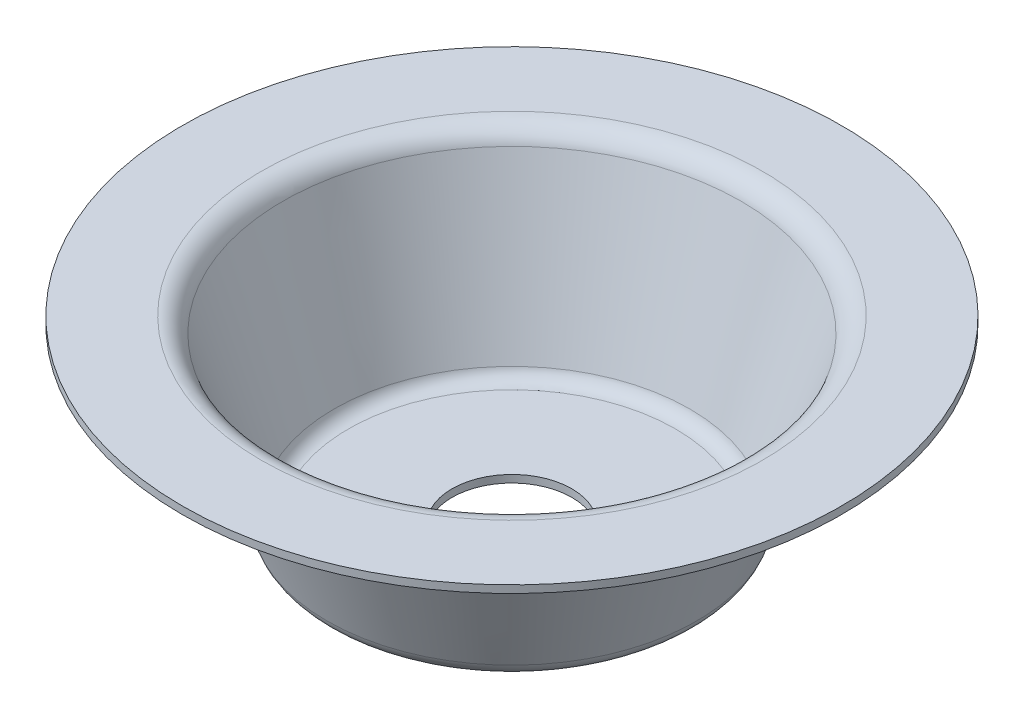
ISO-10303-21;
HEADER;
FILE_DESCRIPTION(('STEP AP214'),'2;1');
FILE_NAME('part.step','',(''),(''),'','','');
FILE_SCHEMA(('AUTOMOTIVE_DESIGN { 1 0 10303 214 1 1 1 1 }'));
ENDSEC;
DATA;
#1=APPLICATION_CONTEXT('core data for automotive mechanical design processes');
#2=APPLICATION_PROTOCOL_DEFINITION('international standard','automotive_design',2000,#1);
#3=PRODUCT_CONTEXT('',#1,'mechanical');
#4=PRODUCT('Part','Part','',(#3));
#5=PRODUCT_RELATED_PRODUCT_CATEGORY('part','',(#4));
#6=PRODUCT_DEFINITION_FORMATION('','',#4);
#7=PRODUCT_DEFINITION_CONTEXT('part definition',#1,'design');
#8=PRODUCT_DEFINITION('design','',#6,#7);
#9=PRODUCT_DEFINITION_SHAPE('','',#8);
#10=(LENGTH_UNIT() NAMED_UNIT(*) SI_UNIT(.MILLI.,.METRE.));
#11=(NAMED_UNIT(*) PLANE_ANGLE_UNIT() SI_UNIT($,.RADIAN.));
#12=(NAMED_UNIT(*) SI_UNIT($,.STERADIAN.) SOLID_ANGLE_UNIT());
#13=UNCERTAINTY_MEASURE_WITH_UNIT(LENGTH_MEASURE(1.E-05),#10,'distance_accuracy_value','');
#14=(GEOMETRIC_REPRESENTATION_CONTEXT(3) GLOBAL_UNCERTAINTY_ASSIGNED_CONTEXT((#13)) GLOBAL_UNIT_ASSIGNED_CONTEXT((#10,
#11,#12)) REPRESENTATION_CONTEXT('',''));
#15=CARTESIAN_POINT('',(0.,0.,0.));
#16=DIRECTION('',(0.,0.,1.));
#17=DIRECTION('',(1.,0.,0.));
#18=AXIS2_PLACEMENT_3D('',#15,#16,#17);
#19=CARTESIAN_POINT('',(-53.0884105236782,39.6875,0.));
#20=DIRECTION('',(0.,1.,0.));
#21=DIRECTION('',(0.,0.,1.));
#22=AXIS2_PLACEMENT_3D('',#19,#20,#21);
#23=PLANE('',#22);
#24=CARTESIAN_POINT('',(0.,39.6875,0.));
#25=DIRECTION('',(0.,1.,0.));
#26=DIRECTION('',(0.,0.,1.));
#27=AXIS2_PLACEMENT_3D('',#24,#25,#26);
#28=CIRCLE('',#27,69.85);
#29=CARTESIAN_POINT('',(0.,39.6875,69.85));
#30=VERTEX_POINT('',#29);
#31=EDGE_CURVE('E10',#30,#30,#28,.T.);
#32=ORIENTED_EDGE('',*,*,#31,.T.);
#33=EDGE_LOOP('',(#32));
#34=FACE_BOUND('',#33,.T.);
#35=CARTESIAN_POINT('',(0.,39.6875,0.));
#36=DIRECTION('',(0.,1.,0.));
#37=DIRECTION('',(0.,0.,1.));
#38=AXIS2_PLACEMENT_3D('',#35,#36,#37);
#39=CIRCLE('',#38,53.0884105236782);
#40=CARTESIAN_POINT('',(0.,39.6875,53.0884105236782));
#41=VERTEX_POINT('',#40);
#42=EDGE_CURVE('E71',#41,#41,#39,.T.);
#43=ORIENTED_EDGE('',*,*,#42,.F.);
#44=EDGE_LOOP('',(#43));
#45=FACE_BOUND('',#44,.T.);
#46=ADVANCED_FACE('F37',(#34,#45),#23,.T.);
#47=CARTESIAN_POINT('',(0.,40.5012674271229,0.));
#48=DIRECTION('',(0.,1.,0.));
#49=DIRECTION('',(0.,0.,1.));
#50=AXIS2_PLACEMENT_3D('',#47,#48,#49);
#51=CYLINDRICAL_SURFACE('',#50,69.85);
#52=ORIENTED_EDGE('',*,*,#31,.F.);
#53=EDGE_LOOP('',(#52));
#54=FACE_BOUND('',#53,.T.);
#55=CARTESIAN_POINT('',(0.,38.1,0.));
#56=DIRECTION('',(0.,1.,0.));
#57=DIRECTION('',(0.,0.,1.));
#58=AXIS2_PLACEMENT_3D('',#55,#56,#57);
#59=CIRCLE('',#58,69.85);
#60=CARTESIAN_POINT('',(0.,38.1,69.85));
#61=VERTEX_POINT('',#60);
#62=EDGE_CURVE('E44',#61,#61,#59,.T.);
#63=ORIENTED_EDGE('',*,*,#62,.T.);
#64=EDGE_LOOP('',(#63));
#65=FACE_BOUND('',#64,.T.);
#66=ADVANCED_FACE('F103',(#54,#65),#51,.T.);
#67=CARTESIAN_POINT('',(-53.0884105236782,38.1,0.));
#68=DIRECTION('',(0.,1.,0.));
#69=DIRECTION('',(0.,0.,1.));
#70=AXIS2_PLACEMENT_3D('',#67,#68,#69);
#71=PLANE('',#70);
#72=ORIENTED_EDGE('',*,*,#62,.F.);
#73=EDGE_LOOP('',(#72));
#74=FACE_BOUND('',#73,.T.);
#75=CARTESIAN_POINT('',(0.,38.1,0.));
#76=DIRECTION('',(0.,1.,0.));
#77=DIRECTION('',(0.,0.,1.));
#78=AXIS2_PLACEMENT_3D('',#75,#76,#77);
#79=CIRCLE('',#78,53.0884105236782);
#80=CARTESIAN_POINT('',(0.,38.1,53.0884105236782));
#81=VERTEX_POINT('',#80);
#82=EDGE_CURVE('E48',#81,#81,#79,.T.);
#83=ORIENTED_EDGE('',*,*,#82,.T.);
#84=EDGE_LOOP('',(#83));
#85=FACE_BOUND('',#84,.T.);
#86=ADVANCED_FACE('F107',(#74,#85),#71,.F.);
#87=CARTESIAN_POINT('',(0.,34.925,0.));
#88=DIRECTION('',(0.,1.,0.));
#89=DIRECTION('',(0.,0.,1.));
#90=AXIS2_PLACEMENT_3D('',#87,#88,#89);
#91=TOROIDAL_SURFACE('',#90,53.0884105236782,3.175);
#92=ORIENTED_EDGE('',*,*,#82,.F.);
#93=EDGE_LOOP('',(#92));
#94=FACE_BOUND('',#93,.T.);
#95=CARTESIAN_POINT('',(0.,35.9290231571034,0.));
#96=DIRECTION('',(0.,1.,0.));
#97=DIRECTION('',(0.,0.,1.));
#98=AXIS2_PLACEMENT_3D('',#95,#96,#97);
#99=CIRCLE('',#98,50.0763410523678);
#100=CARTESIAN_POINT('',(0.,35.9290231571034,50.0763410523678));
#101=VERTEX_POINT('',#100);
#102=EDGE_CURVE('E53',#101,#101,#99,.T.);
#103=ORIENTED_EDGE('',*,*,#102,.T.);
#104=EDGE_LOOP('',(#103));
#105=FACE_BOUND('',#104,.T.);
#106=ADVANCED_FACE('F150',(#94,#105),#91,.F.);
#107=CARTESIAN_POINT('',(0.,3.2564652643448,0.));
#108=DIRECTION('',(0.,1.,0.));
#109=DIRECTION('',(0.,0.,1.));
#110=AXIS2_PLACEMENT_3D('',#107,#108,#109);
#111=CONICAL_SURFACE('',#110,39.1854884214483,0.321750554396642);
#112=ORIENTED_EDGE('',*,*,#102,.F.);
#113=EDGE_LOOP('',(#112));
#114=FACE_BOUND('',#113,.T.);
#115=CARTESIAN_POINT('',(0.,3.2564652643448,0.));
#116=DIRECTION('',(0.,1.,0.));
#117=DIRECTION('',(0.,0.,1.));
#118=AXIS2_PLACEMENT_3D('',#115,#116,#117);
#119=CIRCLE('',#118,39.1854884214483);
#120=CARTESIAN_POINT('',(0.,3.2564652643448,39.1854884214483));
#121=VERTEX_POINT('',#120);
#122=EDGE_CURVE('E56',#121,#121,#119,.T.);
#123=ORIENTED_EDGE('',*,*,#122,.T.);
#124=EDGE_LOOP('',(#123));
#125=FACE_BOUND('',#124,.T.);
#126=ADVANCED_FACE('F142',(#114,#125),#111,.T.);
#127=CARTESIAN_POINT('',(0.,4.7625,0.));
#128=DIRECTION('',(0.,1.,0.));
#129=DIRECTION('',(0.,0.,1.));
#130=AXIS2_PLACEMENT_3D('',#127,#128,#129);
#131=TOROIDAL_SURFACE('',#130,34.6673842144827,4.7625);
#132=ORIENTED_EDGE('',*,*,#122,.F.);
#133=EDGE_LOOP('',(#132));
#134=FACE_BOUND('',#133,.T.);
#135=CARTESIAN_POINT('',(0.,0.,0.));
#136=DIRECTION('',(0.,1.,0.));
#137=DIRECTION('',(0.,0.,1.));
#138=AXIS2_PLACEMENT_3D('',#135,#136,#137);
#139=CIRCLE('',#138,34.6673842144827);
#140=CARTESIAN_POINT('',(0.,0.,34.6673842144827));
#141=VERTEX_POINT('',#140);
#142=EDGE_CURVE('E59',#141,#141,#139,.T.);
#143=ORIENTED_EDGE('',*,*,#142,.T.);
#144=EDGE_LOOP('',(#143));
#145=FACE_BOUND('',#144,.T.);
#146=ADVANCED_FACE('F133',(#134,#145),#131,.T.);
#147=CARTESIAN_POINT('',(0.,0.,0.));
#148=DIRECTION('',(0.,1.,0.));
#149=DIRECTION('',(0.,0.,1.));
#150=AXIS2_PLACEMENT_3D('',#147,#148,#149);
#151=PLANE('',#150);
#152=CARTESIAN_POINT('',(0.,0.,0.));
#153=DIRECTION('',(0.,-1.,0.));
#154=DIRECTION('',(0.,0.,-1.));
#155=AXIS2_PLACEMENT_3D('',#152,#153,#154);
#156=CIRCLE('',#155,12.7);
#157=CARTESIAN_POINT('',(0.,0.,-12.7));
#158=VERTEX_POINT('',#157);
#159=EDGE_CURVE('E74',#158,#158,#156,.T.);
#160=ORIENTED_EDGE('',*,*,#159,.F.);
#161=EDGE_LOOP('',(#160));
#162=FACE_BOUND('',#161,.T.);
#163=ORIENTED_EDGE('',*,*,#142,.F.);
#164=EDGE_LOOP('',(#163));
#165=FACE_BOUND('',#164,.T.);
#166=ADVANCED_FACE('F87',(#162,#165),#151,.F.);
#167=CARTESIAN_POINT('',(0.,1.5875,0.));
#168=DIRECTION('',(0.,1.,0.));
#169=DIRECTION('',(0.,0.,1.));
#170=AXIS2_PLACEMENT_3D('',#167,#168,#169);
#171=PLANE('',#170);
#172=CARTESIAN_POINT('',(0.,1.5875,0.));
#173=DIRECTION('',(0.,1.,0.));
#174=DIRECTION('',(0.,0.,1.));
#175=AXIS2_PLACEMENT_3D('',#172,#173,#174);
#176=CIRCLE('',#175,12.7);
#177=CARTESIAN_POINT('',(0.,1.5875,12.7));
#178=VERTEX_POINT('',#177);
#179=EDGE_CURVE('E40',#178,#178,#176,.T.);
#180=ORIENTED_EDGE('',*,*,#179,.F.);
#181=EDGE_LOOP('',(#180));
#182=FACE_BOUND('',#181,.T.);
#183=CARTESIAN_POINT('',(0.,1.5875,0.));
#184=DIRECTION('',(0.,1.,0.));
#185=DIRECTION('',(0.,0.,1.));
#186=AXIS2_PLACEMENT_3D('',#183,#184,#185);
#187=CIRCLE('',#186,34.6673842144827);
#188=CARTESIAN_POINT('',(0.,1.5875,34.6673842144827));
#189=VERTEX_POINT('',#188);
#190=EDGE_CURVE('E62',#189,#189,#187,.T.);
#191=ORIENTED_EDGE('',*,*,#190,.T.);
#192=EDGE_LOOP('',(#191));
#193=FACE_BOUND('',#192,.T.);
#194=ADVANCED_FACE('F83',(#182,#193),#171,.T.);
#195=CARTESIAN_POINT('',(0.,4.7625,0.));
#196=DIRECTION('',(0.,1.,0.));
#197=DIRECTION('',(0.,0.,1.));
#198=AXIS2_PLACEMENT_3D('',#195,#196,#197);
#199=TOROIDAL_SURFACE('',#198,34.6673842144827,3.175);
#200=CARTESIAN_POINT('',(0.,3.75847684289653,0.));
#201=DIRECTION('',(0.,1.,0.));
#202=DIRECTION('',(0.,0.,1.));
#203=AXIS2_PLACEMENT_3D('',#200,#201,#202);
#204=CIRCLE('',#203,37.6794536857931);
#205=CARTESIAN_POINT('',(0.,3.75847684289653,37.6794536857931));
#206=VERTEX_POINT('',#205);
#207=EDGE_CURVE('E65',#206,#206,#204,.T.);
#208=ORIENTED_EDGE('',*,*,#207,.T.);
#209=EDGE_LOOP('',(#208));
#210=FACE_BOUND('',#209,.T.);
#211=ORIENTED_EDGE('',*,*,#190,.F.);
#212=EDGE_LOOP('',(#211));
#213=FACE_BOUND('',#212,.T.);
#214=ADVANCED_FACE('F86',(#210,#213),#199,.F.);
#215=CARTESIAN_POINT('',(0.,3.75847684289653,0.));
#216=DIRECTION('',(0.,1.,0.));
#217=DIRECTION('',(0.,0.,1.));
#218=AXIS2_PLACEMENT_3D('',#215,#216,#217);
#219=CONICAL_SURFACE('',#218,37.6794536857931,0.321750554396642);
#220=CARTESIAN_POINT('',(0.,36.4310347356552,0.));
#221=DIRECTION('',(0.,1.,0.));
#222=DIRECTION('',(0.,0.,1.));
#223=AXIS2_PLACEMENT_3D('',#220,#221,#222);
#224=CIRCLE('',#223,48.5703063167126);
#225=CARTESIAN_POINT('',(0.,36.4310347356552,48.5703063167126));
#226=VERTEX_POINT('',#225);
#227=EDGE_CURVE('E68',#226,#226,#224,.T.);
#228=ORIENTED_EDGE('',*,*,#227,.T.);
#229=EDGE_LOOP('',(#228));
#230=FACE_BOUND('',#229,.T.);
#231=ORIENTED_EDGE('',*,*,#207,.F.);
#232=EDGE_LOOP('',(#231));
#233=FACE_BOUND('',#232,.T.);
#234=ADVANCED_FACE('F92',(#230,#233),#219,.F.);
#235=CARTESIAN_POINT('',(0.,34.925,0.));
#236=DIRECTION('',(0.,1.,0.));
#237=DIRECTION('',(0.,0.,1.));
#238=AXIS2_PLACEMENT_3D('',#235,#236,#237);
#239=TOROIDAL_SURFACE('',#238,53.0884105236782,4.7625);
#240=ORIENTED_EDGE('',*,*,#42,.T.);
#241=EDGE_LOOP('',(#240));
#242=FACE_BOUND('',#241,.T.);
#243=ORIENTED_EDGE('',*,*,#227,.F.);
#244=EDGE_LOOP('',(#243));
#245=FACE_BOUND('',#244,.T.);
#246=ADVANCED_FACE('F99',(#242,#245),#239,.T.);
#247=CARTESIAN_POINT('',(0.,39.6875,0.));
#248=DIRECTION('',(0.,-1.,0.));
#249=DIRECTION('',(0.,0.,-1.));
#250=AXIS2_PLACEMENT_3D('',#247,#248,#249);
#251=CYLINDRICAL_SURFACE('',#250,12.7);
#252=ORIENTED_EDGE('',*,*,#179,.T.);
#253=EDGE_LOOP('',(#252));
#254=FACE_BOUND('',#253,.T.);
#255=ORIENTED_EDGE('',*,*,#159,.T.);
#256=EDGE_LOOP('',(#255));
#257=FACE_BOUND('',#256,.T.);
#258=ADVANCED_FACE('F81',(#254,#257),#251,.F.);
#259=CLOSED_SHELL('',(#46,#66,#86,#106,#126,#146,#166,#194,#214,#234,#246,#258));
#260=MANIFOLD_SOLID_BREP('B2',#259);
#261=ADVANCED_BREP_SHAPE_REPRESENTATION('',(#18,#260),#14);
#262=SHAPE_DEFINITION_REPRESENTATION(#9,#261);
ENDSEC;
END-ISO-10303-21;
